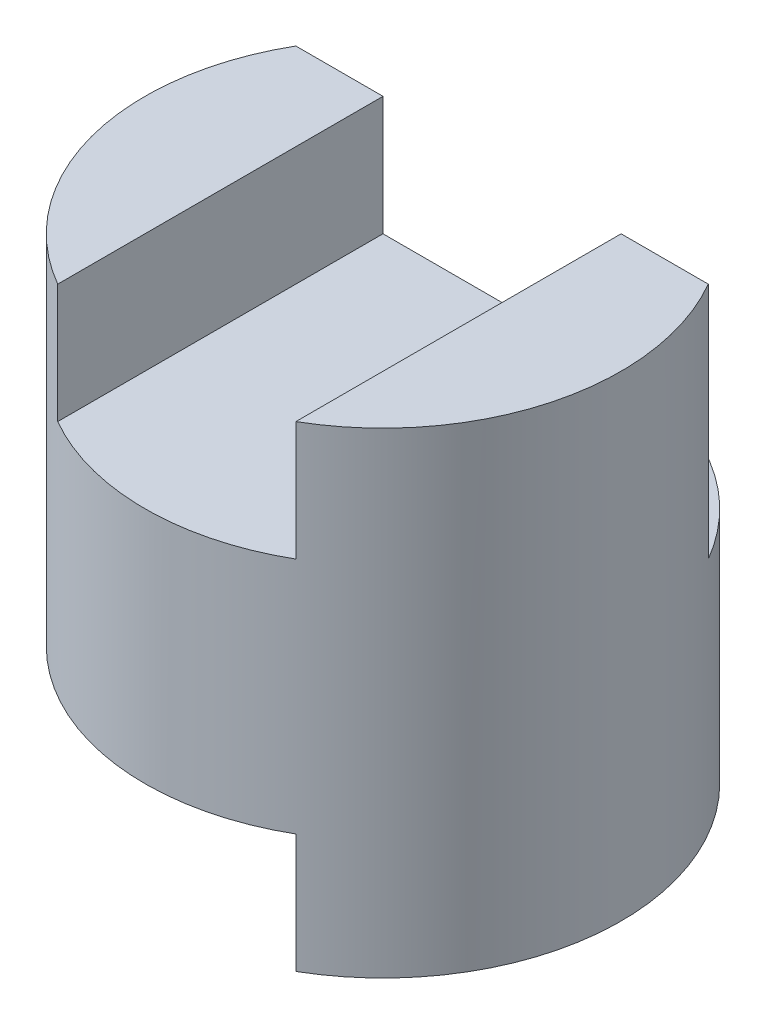
ISO-10303-21;
HEADER;
FILE_DESCRIPTION(('STEP AP214'),'2;1');
FILE_NAME('part.step','',(''),(''),'','','');
FILE_SCHEMA(('AUTOMOTIVE_DESIGN { 1 0 10303 214 1 1 1 1 }'));
ENDSEC;
DATA;
#1=APPLICATION_CONTEXT('core data for automotive mechanical design processes');
#2=APPLICATION_PROTOCOL_DEFINITION('international standard','automotive_design',2000,#1);
#3=PRODUCT_CONTEXT('',#1,'mechanical');
#4=PRODUCT('Part','Part','',(#3));
#5=PRODUCT_RELATED_PRODUCT_CATEGORY('part','',(#4));
#6=PRODUCT_DEFINITION_FORMATION('','',#4);
#7=PRODUCT_DEFINITION_CONTEXT('part definition',#1,'design');
#8=PRODUCT_DEFINITION('design','',#6,#7);
#9=PRODUCT_DEFINITION_SHAPE('','',#8);
#10=(LENGTH_UNIT() NAMED_UNIT(*) SI_UNIT(.MILLI.,.METRE.));
#11=(NAMED_UNIT(*) PLANE_ANGLE_UNIT() SI_UNIT($,.RADIAN.));
#12=(NAMED_UNIT(*) SI_UNIT($,.STERADIAN.) SOLID_ANGLE_UNIT());
#13=UNCERTAINTY_MEASURE_WITH_UNIT(LENGTH_MEASURE(1.E-05),#10,'distance_accuracy_value','');
#14=(GEOMETRIC_REPRESENTATION_CONTEXT(3) GLOBAL_UNCERTAINTY_ASSIGNED_CONTEXT((#13)) GLOBAL_UNIT_ASSIGNED_CONTEXT((#10,
#11,#12)) REPRESENTATION_CONTEXT('',''));
#15=CARTESIAN_POINT('',(0.,0.,0.));
#16=DIRECTION('',(0.,0.,1.));
#17=DIRECTION('',(1.,0.,0.));
#18=AXIS2_PLACEMENT_3D('',#15,#16,#17);
#19=CARTESIAN_POINT('',(0.,4.,0.));
#20=DIRECTION('',(0.,1.,0.));
#21=DIRECTION('',(0.,0.,1.));
#22=AXIS2_PLACEMENT_3D('',#19,#20,#21);
#23=PLANE('',#22);
#24=DIRECTION('',(1.,0.,0.));
#25=VECTOR('',#24,1.);
#26=CARTESIAN_POINT('',(-1.73205080756888,4.,-1.));
#27=LINE('',#26,#25);
#28=CARTESIAN_POINT('',(-1.73205080756888,4.,-1.));
#29=VERTEX_POINT('',#28);
#30=CARTESIAN_POINT('',(-1.,4.,-1.));
#31=VERTEX_POINT('',#30);
#32=EDGE_CURVE('E113',#29,#31,#27,.T.);
#33=ORIENTED_EDGE('',*,*,#32,.F.);
#34=CARTESIAN_POINT('',(0.,4.,0.));
#35=DIRECTION('',(0.,1.,0.));
#36=DIRECTION('',(0.,0.,1.));
#37=AXIS2_PLACEMENT_3D('',#34,#35,#36);
#38=CIRCLE('',#37,2.);
#39=CARTESIAN_POINT('',(-1.,4.,1.73205080756888));
#40=VERTEX_POINT('',#39);
#41=EDGE_CURVE('E124',#29,#40,#38,.T.);
#42=ORIENTED_EDGE('',*,*,#41,.T.);
#43=DIRECTION('',(0.,0.,-1.));
#44=VECTOR('',#43,1.);
#45=CARTESIAN_POINT('',(-1.,4.,0.));
#46=LINE('',#45,#44);
#47=EDGE_CURVE('E165',#40,#31,#46,.T.);
#48=ORIENTED_EDGE('',*,*,#47,.T.);
#49=EDGE_LOOP('',(#33,#42,#48));
#50=FACE_BOUND('',#49,.T.);
#51=ADVANCED_FACE('F33',(#50),#23,.T.);
#52=CARTESIAN_POINT('',(0.,4.,0.));
#53=DIRECTION('',(0.,-1.,0.));
#54=DIRECTION('',(0.,0.,-1.));
#55=AXIS2_PLACEMENT_3D('',#52,#53,#54);
#56=CYLINDRICAL_SURFACE('',#55,2.);
#57=ORIENTED_EDGE('',*,*,#41,.F.);
#58=DIRECTION('',(0.,1.,0.));
#59=VECTOR('',#58,1.);
#60=CARTESIAN_POINT('',(-1.73205080756888,2.,-1.));
#61=LINE('',#60,#59);
#62=CARTESIAN_POINT('',(-1.73205080756888,2.,-1.));
#63=VERTEX_POINT('',#62);
#64=EDGE_CURVE('E117',#63,#29,#61,.T.);
#65=ORIENTED_EDGE('',*,*,#64,.F.);
#66=CARTESIAN_POINT('',(0.,2.,0.));
#67=DIRECTION('',(0.,1.,0.));
#68=DIRECTION('',(0.,0.,-1.));
#69=AXIS2_PLACEMENT_3D('',#66,#67,#68);
#70=CIRCLE('',#69,2.);
#71=CARTESIAN_POINT('',(1.73205080756888,2.,-1.));
#72=VERTEX_POINT('',#71);
#73=EDGE_CURVE('E106',#72,#63,#70,.T.);
#74=ORIENTED_EDGE('',*,*,#73,.F.);
#75=DIRECTION('',(0.,1.,0.));
#76=VECTOR('',#75,1.);
#77=CARTESIAN_POINT('',(1.73205080756888,2.,-1.));
#78=LINE('',#77,#76);
#79=CARTESIAN_POINT('',(1.73205080756888,4.,-1.));
#80=VERTEX_POINT('',#79);
#81=EDGE_CURVE('E119',#72,#80,#78,.T.);
#82=ORIENTED_EDGE('',*,*,#81,.T.);
#83=CARTESIAN_POINT('',(1.,4.,1.73205080756888));
#84=VERTEX_POINT('',#83);
#85=EDGE_CURVE('E156',#84,#80,#38,.T.);
#86=ORIENTED_EDGE('',*,*,#85,.F.);
#87=DIRECTION('',(0.,-1.,0.));
#88=VECTOR('',#87,1.);
#89=CARTESIAN_POINT('',(1.,4.,1.73205080756888));
#90=LINE('',#89,#88);
#91=CARTESIAN_POINT('',(1.,3.,1.73205080756888));
#92=VERTEX_POINT('',#91);
#93=EDGE_CURVE('E56',#92,#84,#90,.F.);
#94=ORIENTED_EDGE('',*,*,#93,.F.);
#95=CARTESIAN_POINT('',(0.,3.,0.));
#96=DIRECTION('',(0.,1.,0.));
#97=DIRECTION('',(0.,0.,1.));
#98=AXIS2_PLACEMENT_3D('',#95,#96,#97);
#99=CIRCLE('',#98,2.);
#100=CARTESIAN_POINT('',(-1.,3.,1.73205080756888));
#101=VERTEX_POINT('',#100);
#102=EDGE_CURVE('E11',#101,#92,#99,.T.);
#103=ORIENTED_EDGE('',*,*,#102,.F.);
#104=DIRECTION('',(0.,-1.,0.));
#105=VECTOR('',#104,1.);
#106=CARTESIAN_POINT('',(-1.,4.,1.73205080756888));
#107=LINE('',#106,#105);
#108=EDGE_CURVE('E152',#40,#101,#107,.T.);
#109=ORIENTED_EDGE('',*,*,#108,.F.);
#110=EDGE_LOOP('',(#57,#65,#74,#82,#86,#94,#103,#109));
#111=FACE_BOUND('',#110,.T.);
#112=DIRECTION('',(0.,-1.,0.));
#113=VECTOR('',#112,1.);
#114=CARTESIAN_POINT('',(1.,4.,1.73205080756888));
#115=LINE('',#114,#113);
#116=CARTESIAN_POINT('',(1.,0.,1.73205080756888));
#117=VERTEX_POINT('',#116);
#118=CARTESIAN_POINT('',(1.,1.,1.73205080756888));
#119=VERTEX_POINT('',#118);
#120=EDGE_CURVE('E149',#117,#119,#115,.F.);
#121=ORIENTED_EDGE('',*,*,#120,.F.);
#122=CARTESIAN_POINT('',(0.,0.,0.));
#123=DIRECTION('',(0.,1.,0.));
#124=DIRECTION('',(0.,0.,1.));
#125=AXIS2_PLACEMENT_3D('',#122,#123,#124);
#126=CIRCLE('',#125,2.);
#127=CARTESIAN_POINT('',(-1.73205080756888,0.,-1.));
#128=VERTEX_POINT('',#127);
#129=EDGE_CURVE('E155',#117,#128,#126,.T.);
#130=ORIENTED_EDGE('',*,*,#129,.T.);
#131=DIRECTION('',(0.,-1.,0.));
#132=VECTOR('',#131,1.);
#133=CARTESIAN_POINT('',(-1.73205080756888,4.,-1.));
#134=LINE('',#133,#132);
#135=CARTESIAN_POINT('',(-1.73205080756888,1.,-1.));
#136=VERTEX_POINT('',#135);
#137=EDGE_CURVE('E48',#128,#136,#134,.F.);
#138=ORIENTED_EDGE('',*,*,#137,.T.);
#139=CARTESIAN_POINT('',(0.,1.,0.));
#140=DIRECTION('',(0.,-1.,0.));
#141=DIRECTION('',(0.,0.,-1.));
#142=AXIS2_PLACEMENT_3D('',#139,#140,#141);
#143=CIRCLE('',#142,2.);
#144=EDGE_CURVE('E41',#119,#136,#143,.T.);
#145=ORIENTED_EDGE('',*,*,#144,.F.);
#146=EDGE_LOOP('',(#121,#130,#138,#145));
#147=FACE_BOUND('',#146,.T.);
#148=ADVANCED_FACE('F35',(#111,#147),#56,.T.);
#149=CARTESIAN_POINT('',(1.,4.,-1.));
#150=VERTEX_POINT('',#149);
#151=EDGE_CURVE('E204',#150,#80,#27,.T.);
#152=ORIENTED_EDGE('',*,*,#151,.F.);
#153=DIRECTION('',(0.,0.,1.));
#154=VECTOR('',#153,1.);
#155=CARTESIAN_POINT('',(1.,4.,0.));
#156=LINE('',#155,#154);
#157=EDGE_CURVE('E168',#150,#84,#156,.T.);
#158=ORIENTED_EDGE('',*,*,#157,.T.);
#159=ORIENTED_EDGE('',*,*,#85,.T.);
#160=EDGE_LOOP('',(#152,#158,#159));
#161=FACE_BOUND('',#160,.T.);
#162=ADVANCED_FACE('F194',(#161),#23,.T.);
#163=CARTESIAN_POINT('',(0.,0.,0.));
#164=DIRECTION('',(0.,1.,0.));
#165=DIRECTION('',(0.,0.,1.));
#166=AXIS2_PLACEMENT_3D('',#163,#164,#165);
#167=PLANE('',#166);
#168=DIRECTION('',(0.,0.,1.));
#169=VECTOR('',#168,1.);
#170=CARTESIAN_POINT('',(1.,0.,0.));
#171=LINE('',#170,#169);
#172=CARTESIAN_POINT('',(1.,0.,-1.));
#173=VERTEX_POINT('',#172);
#174=EDGE_CURVE('E163',#173,#117,#171,.T.);
#175=ORIENTED_EDGE('',*,*,#174,.F.);
#176=DIRECTION('',(-1.,0.,0.));
#177=VECTOR('',#176,1.);
#178=CARTESIAN_POINT('',(0.,0.,-1.));
#179=LINE('',#178,#177);
#180=EDGE_CURVE('E159',#173,#128,#179,.T.);
#181=ORIENTED_EDGE('',*,*,#180,.T.);
#182=ORIENTED_EDGE('',*,*,#129,.F.);
#183=EDGE_LOOP('',(#175,#181,#182));
#184=FACE_BOUND('',#183,.T.);
#185=ADVANCED_FACE('F179',(#184),#167,.F.);
#186=CARTESIAN_POINT('',(-2.,1.,3.));
#187=DIRECTION('',(0.,-1.,0.));
#188=DIRECTION('',(0.,0.,-1.));
#189=AXIS2_PLACEMENT_3D('',#186,#187,#188);
#190=PLANE('',#189);
#191=DIRECTION('',(0.,0.,-1.));
#192=VECTOR('',#191,1.);
#193=CARTESIAN_POINT('',(1.,1.,3.));
#194=LINE('',#193,#192);
#195=CARTESIAN_POINT('',(1.,1.,-1.));
#196=VERTEX_POINT('',#195);
#197=EDGE_CURVE('E133',#119,#196,#194,.T.);
#198=ORIENTED_EDGE('',*,*,#197,.F.);
#199=ORIENTED_EDGE('',*,*,#144,.T.);
#200=DIRECTION('',(-1.,0.,0.));
#201=VECTOR('',#200,1.);
#202=CARTESIAN_POINT('',(-2.,1.,-1.));
#203=LINE('',#202,#201);
#204=EDGE_CURVE('E145',#196,#136,#203,.T.);
#205=ORIENTED_EDGE('',*,*,#204,.F.);
#206=EDGE_LOOP('',(#198,#199,#205));
#207=FACE_BOUND('',#206,.T.);
#208=ADVANCED_FACE('F172',(#207),#190,.T.);
#209=CARTESIAN_POINT('',(1.,0.,3.));
#210=DIRECTION('',(-1.,0.,0.));
#211=DIRECTION('',(0.,0.,1.));
#212=AXIS2_PLACEMENT_3D('',#209,#210,#211);
#213=PLANE('',#212);
#214=ORIENTED_EDGE('',*,*,#120,.T.);
#215=ORIENTED_EDGE('',*,*,#197,.T.);
#216=DIRECTION('',(0.,1.,0.));
#217=VECTOR('',#216,1.);
#218=CARTESIAN_POINT('',(1.,0.,-1.));
#219=LINE('',#218,#217);
#220=EDGE_CURVE('E126',#173,#196,#219,.T.);
#221=ORIENTED_EDGE('',*,*,#220,.F.);
#222=ORIENTED_EDGE('',*,*,#174,.T.);
#223=EDGE_LOOP('',(#214,#215,#221,#222));
#224=FACE_BOUND('',#223,.T.);
#225=ADVANCED_FACE('F181',(#224),#213,.T.);
#226=CARTESIAN_POINT('',(0.,0.,-1.));
#227=DIRECTION('',(0.,0.,-1.));
#228=DIRECTION('',(-1.,0.,0.));
#229=AXIS2_PLACEMENT_3D('',#226,#227,#228);
#230=PLANE('',#229);
#231=ORIENTED_EDGE('',*,*,#180,.F.);
#232=ORIENTED_EDGE('',*,*,#220,.T.);
#233=ORIENTED_EDGE('',*,*,#204,.T.);
#234=ORIENTED_EDGE('',*,*,#137,.F.);
#235=EDGE_LOOP('',(#231,#232,#233,#234));
#236=FACE_BOUND('',#235,.T.);
#237=ADVANCED_FACE('F174',(#236),#230,.F.);
#238=CARTESIAN_POINT('',(1.,3.,3.));
#239=DIRECTION('',(0.,1.,0.));
#240=DIRECTION('',(0.,0.,1.));
#241=AXIS2_PLACEMENT_3D('',#238,#239,#240);
#242=PLANE('',#241);
#243=ORIENTED_EDGE('',*,*,#102,.T.);
#244=DIRECTION('',(0.,0.,-1.));
#245=VECTOR('',#244,1.);
#246=CARTESIAN_POINT('',(1.,3.,3.));
#247=LINE('',#246,#245);
#248=CARTESIAN_POINT('',(1.,3.,-1.));
#249=VERTEX_POINT('',#248);
#250=EDGE_CURVE('E140',#92,#249,#247,.T.);
#251=ORIENTED_EDGE('',*,*,#250,.T.);
#252=DIRECTION('',(1.,0.,0.));
#253=VECTOR('',#252,1.);
#254=CARTESIAN_POINT('',(1.,3.,-1.));
#255=LINE('',#254,#253);
#256=CARTESIAN_POINT('',(-1.,3.,-1.));
#257=VERTEX_POINT('',#256);
#258=EDGE_CURVE('E130',#257,#249,#255,.T.);
#259=ORIENTED_EDGE('',*,*,#258,.F.);
#260=DIRECTION('',(0.,0.,-1.));
#261=VECTOR('',#260,1.);
#262=CARTESIAN_POINT('',(-1.,3.,3.));
#263=LINE('',#262,#261);
#264=EDGE_CURVE('E137',#101,#257,#263,.T.);
#265=ORIENTED_EDGE('',*,*,#264,.F.);
#266=EDGE_LOOP('',(#243,#251,#259,#265));
#267=FACE_BOUND('',#266,.T.);
#268=ADVANCED_FACE('F188',(#267),#242,.T.);
#269=CARTESIAN_POINT('',(1.,4.,3.));
#270=DIRECTION('',(-1.,0.,0.));
#271=DIRECTION('',(0.,0.,1.));
#272=AXIS2_PLACEMENT_3D('',#269,#270,#271);
#273=PLANE('',#272);
#274=ORIENTED_EDGE('',*,*,#93,.T.);
#275=ORIENTED_EDGE('',*,*,#157,.F.);
#276=DIRECTION('',(0.,1.,0.));
#277=VECTOR('',#276,1.);
#278=CARTESIAN_POINT('',(1.,4.,-1.));
#279=LINE('',#278,#277);
#280=EDGE_CURVE('E132',#249,#150,#279,.T.);
#281=ORIENTED_EDGE('',*,*,#280,.F.);
#282=ORIENTED_EDGE('',*,*,#250,.F.);
#283=EDGE_LOOP('',(#274,#275,#281,#282));
#284=FACE_BOUND('',#283,.T.);
#285=ADVANCED_FACE('F207',(#284),#273,.T.);
#286=CARTESIAN_POINT('',(-1.,3.,3.));
#287=DIRECTION('',(1.,0.,0.));
#288=DIRECTION('',(0.,0.,-1.));
#289=AXIS2_PLACEMENT_3D('',#286,#287,#288);
#290=PLANE('',#289);
#291=ORIENTED_EDGE('',*,*,#108,.T.);
#292=ORIENTED_EDGE('',*,*,#264,.T.);
#293=DIRECTION('',(0.,-1.,0.));
#294=VECTOR('',#293,1.);
#295=CARTESIAN_POINT('',(-1.,3.,-1.));
#296=LINE('',#295,#294);
#297=EDGE_CURVE('E135',#31,#257,#296,.T.);
#298=ORIENTED_EDGE('',*,*,#297,.F.);
#299=ORIENTED_EDGE('',*,*,#47,.F.);
#300=EDGE_LOOP('',(#291,#292,#298,#299));
#301=FACE_BOUND('',#300,.T.);
#302=ADVANCED_FACE('F215',(#301),#290,.T.);
#303=CARTESIAN_POINT('',(-1.73205080756888,2.,-1.));
#304=DIRECTION('',(0.,0.,1.));
#305=DIRECTION('',(1.,0.,0.));
#306=AXIS2_PLACEMENT_3D('',#303,#304,#305);
#307=PLANE('',#306);
#308=ORIENTED_EDGE('',*,*,#280,.T.);
#309=ORIENTED_EDGE('',*,*,#151,.T.);
#310=ORIENTED_EDGE('',*,*,#81,.F.);
#311=DIRECTION('',(1.,0.,0.));
#312=VECTOR('',#311,1.);
#313=CARTESIAN_POINT('',(-1.73205080756888,2.,-1.));
#314=LINE('',#313,#312);
#315=EDGE_CURVE('E109',#63,#72,#314,.T.);
#316=ORIENTED_EDGE('',*,*,#315,.F.);
#317=ORIENTED_EDGE('',*,*,#64,.T.);
#318=ORIENTED_EDGE('',*,*,#32,.T.);
#319=ORIENTED_EDGE('',*,*,#297,.T.);
#320=ORIENTED_EDGE('',*,*,#258,.T.);
#321=EDGE_LOOP('',(#308,#309,#310,#316,#317,#318,#319,#320));
#322=FACE_BOUND('',#321,.T.);
#323=ADVANCED_FACE('F116',(#322),#307,.F.);
#324=CARTESIAN_POINT('',(0.,2.,0.));
#325=DIRECTION('',(0.,-1.,0.));
#326=DIRECTION('',(0.,0.,-1.));
#327=AXIS2_PLACEMENT_3D('',#324,#325,#326);
#328=PLANE('',#327);
#329=ORIENTED_EDGE('',*,*,#73,.T.);
#330=ORIENTED_EDGE('',*,*,#315,.T.);
#331=EDGE_LOOP('',(#329,#330));
#332=FACE_BOUND('',#331,.T.);
#333=ADVANCED_FACE('F108',(#332),#328,.F.);
#334=CLOSED_SHELL('',(#51,#148,#162,#185,#208,#225,#237,#268,#285,#302,#323,#333));
#335=MANIFOLD_SOLID_BREP('B2',#334);
#336=ADVANCED_BREP_SHAPE_REPRESENTATION('',(#18,#335),#14);
#337=SHAPE_DEFINITION_REPRESENTATION(#9,#336);
ENDSEC;
END-ISO-10303-21;
